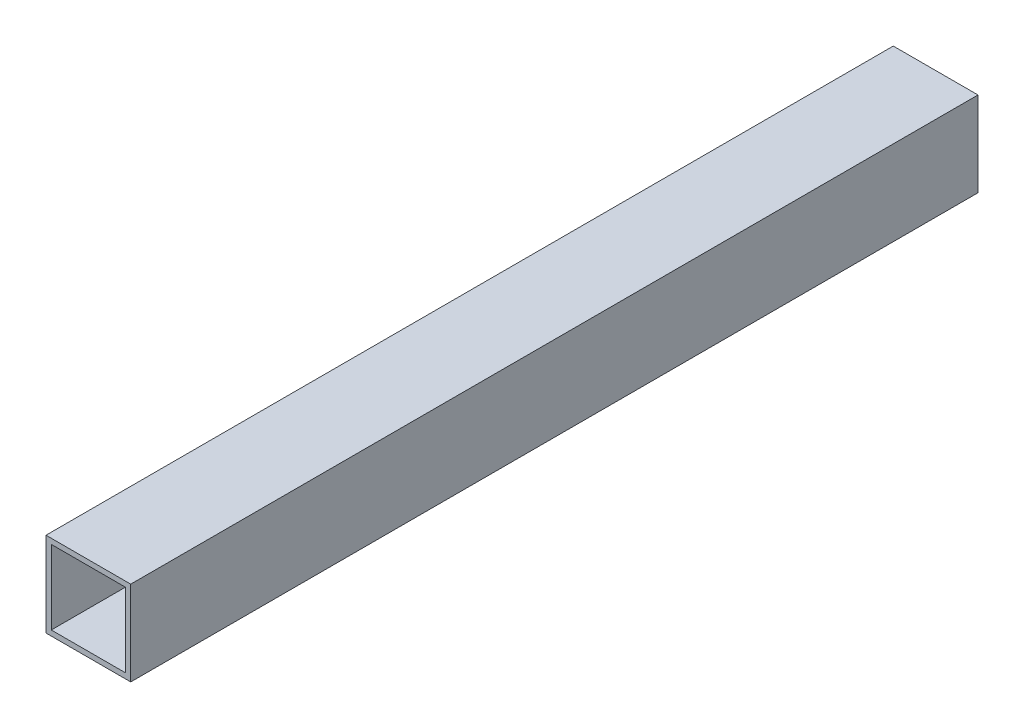
ISO-10303-21;
HEADER;
FILE_DESCRIPTION(('STEP AP214'),'2;1');
FILE_NAME('part.step','',(''),(''),'','','');
FILE_SCHEMA(('AUTOMOTIVE_DESIGN { 1 0 10303 214 1 1 1 1 }'));
ENDSEC;
DATA;
#1=APPLICATION_CONTEXT('core data for automotive mechanical design processes');
#2=APPLICATION_PROTOCOL_DEFINITION('international standard','automotive_design',2000,#1);
#3=PRODUCT_CONTEXT('',#1,'mechanical');
#4=PRODUCT('Part','Part','',(#3));
#5=PRODUCT_RELATED_PRODUCT_CATEGORY('part','',(#4));
#6=PRODUCT_DEFINITION_FORMATION('','',#4);
#7=PRODUCT_DEFINITION_CONTEXT('part definition',#1,'design');
#8=PRODUCT_DEFINITION('design','',#6,#7);
#9=PRODUCT_DEFINITION_SHAPE('','',#8);
#10=(LENGTH_UNIT() NAMED_UNIT(*) SI_UNIT(.MILLI.,.METRE.));
#11=(NAMED_UNIT(*) PLANE_ANGLE_UNIT() SI_UNIT($,.RADIAN.));
#12=(NAMED_UNIT(*) SI_UNIT($,.STERADIAN.) SOLID_ANGLE_UNIT());
#13=UNCERTAINTY_MEASURE_WITH_UNIT(LENGTH_MEASURE(1.E-05),#10,'distance_accuracy_value','');
#14=(GEOMETRIC_REPRESENTATION_CONTEXT(3) GLOBAL_UNCERTAINTY_ASSIGNED_CONTEXT((#13)) GLOBAL_UNIT_ASSIGNED_CONTEXT((#10,
#11,#12)) REPRESENTATION_CONTEXT('',''));
#15=CARTESIAN_POINT('',(0.,0.,0.));
#16=DIRECTION('',(0.,0.,1.));
#17=DIRECTION('',(1.,0.,0.));
#18=AXIS2_PLACEMENT_3D('',#15,#16,#17);
#19=CARTESIAN_POINT('',(0.,0.,508.));
#20=DIRECTION('',(0.,0.,-1.));
#21=DIRECTION('',(-1.,0.,0.));
#22=AXIS2_PLACEMENT_3D('',#19,#20,#21);
#23=PLANE('',#22);
#24=DIRECTION('',(0.,-1.,0.));
#25=VECTOR('',#24,1.);
#26=CARTESIAN_POINT('',(0.,0.,508.));
#27=LINE('',#26,#25);
#28=CARTESIAN_POINT('',(0.,50.8,508.));
#29=VERTEX_POINT('',#28);
#30=CARTESIAN_POINT('',(0.,0.,508.));
#31=VERTEX_POINT('',#30);
#32=EDGE_CURVE('E141',#29,#31,#27,.T.);
#33=ORIENTED_EDGE('',*,*,#32,.T.);
#34=DIRECTION('',(1.,0.,0.));
#35=VECTOR('',#34,1.);
#36=CARTESIAN_POINT('',(0.,0.,508.));
#37=LINE('',#36,#35);
#38=CARTESIAN_POINT('',(50.8,0.,508.));
#39=VERTEX_POINT('',#38);
#40=EDGE_CURVE('E144',#31,#39,#37,.T.);
#41=ORIENTED_EDGE('',*,*,#40,.T.);
#42=DIRECTION('',(0.,1.,0.));
#43=VECTOR('',#42,1.);
#44=CARTESIAN_POINT('',(50.8,0.,508.));
#45=LINE('',#44,#43);
#46=CARTESIAN_POINT('',(50.8,50.8,508.));
#47=VERTEX_POINT('',#46);
#48=EDGE_CURVE('E147',#39,#47,#45,.T.);
#49=ORIENTED_EDGE('',*,*,#48,.T.);
#50=DIRECTION('',(-1.,0.,0.));
#51=VECTOR('',#50,1.);
#52=CARTESIAN_POINT('',(0.,50.8,508.));
#53=LINE('',#52,#51);
#54=EDGE_CURVE('E149',#47,#29,#53,.T.);
#55=ORIENTED_EDGE('',*,*,#54,.T.);
#56=EDGE_LOOP('',(#33,#41,#49,#55));
#57=FACE_BOUND('',#56,.T.);
#58=DIRECTION('',(0.,-1.,0.));
#59=VECTOR('',#58,1.);
#60=CARTESIAN_POINT('',(3.175,3.175,508.));
#61=LINE('',#60,#59);
#62=CARTESIAN_POINT('',(3.175,47.625,508.));
#63=VERTEX_POINT('',#62);
#64=CARTESIAN_POINT('',(3.175,3.175,508.));
#65=VERTEX_POINT('',#64);
#66=EDGE_CURVE('E105',#63,#65,#61,.T.);
#67=ORIENTED_EDGE('',*,*,#66,.F.);
#68=DIRECTION('',(-1.,0.,0.));
#69=VECTOR('',#68,1.);
#70=CARTESIAN_POINT('',(3.175,47.625,508.));
#71=LINE('',#70,#69);
#72=CARTESIAN_POINT('',(47.625,47.625,508.));
#73=VERTEX_POINT('',#72);
#74=EDGE_CURVE('E127',#73,#63,#71,.T.);
#75=ORIENTED_EDGE('',*,*,#74,.F.);
#76=DIRECTION('',(0.,1.,0.));
#77=VECTOR('',#76,1.);
#78=CARTESIAN_POINT('',(47.625,3.175,508.));
#79=LINE('',#78,#77);
#80=CARTESIAN_POINT('',(47.625,3.175,508.));
#81=VERTEX_POINT('',#80);
#82=EDGE_CURVE('E125',#81,#73,#79,.T.);
#83=ORIENTED_EDGE('',*,*,#82,.F.);
#84=DIRECTION('',(1.,0.,0.));
#85=VECTOR('',#84,1.);
#86=CARTESIAN_POINT('',(3.175,3.175,508.));
#87=LINE('',#86,#85);
#88=EDGE_CURVE('E113',#65,#81,#87,.T.);
#89=ORIENTED_EDGE('',*,*,#88,.F.);
#90=EDGE_LOOP('',(#67,#75,#83,#89));
#91=FACE_BOUND('',#90,.T.);
#92=ADVANCED_FACE('F40',(#57,#91),#23,.F.);
#93=CARTESIAN_POINT('',(0.,0.,0.));
#94=DIRECTION('',(0.,0.,-1.));
#95=DIRECTION('',(-1.,0.,0.));
#96=AXIS2_PLACEMENT_3D('',#93,#94,#95);
#97=PLANE('',#96);
#98=DIRECTION('',(0.,-1.,0.));
#99=VECTOR('',#98,1.);
#100=CARTESIAN_POINT('',(0.,0.,0.));
#101=LINE('',#100,#99);
#102=CARTESIAN_POINT('',(0.,50.8,0.));
#103=VERTEX_POINT('',#102);
#104=CARTESIAN_POINT('',(0.,0.,0.));
#105=VERTEX_POINT('',#104);
#106=EDGE_CURVE('E121',#103,#105,#101,.T.);
#107=ORIENTED_EDGE('',*,*,#106,.F.);
#108=DIRECTION('',(-1.,0.,0.));
#109=VECTOR('',#108,1.);
#110=CARTESIAN_POINT('',(0.,50.8,0.));
#111=LINE('',#110,#109);
#112=CARTESIAN_POINT('',(50.8,50.8,0.));
#113=VERTEX_POINT('',#112);
#114=EDGE_CURVE('E145',#113,#103,#111,.T.);
#115=ORIENTED_EDGE('',*,*,#114,.F.);
#116=DIRECTION('',(0.,1.,0.));
#117=VECTOR('',#116,1.);
#118=CARTESIAN_POINT('',(50.8,0.,0.));
#119=LINE('',#118,#117);
#120=CARTESIAN_POINT('',(50.8,0.,0.));
#121=VERTEX_POINT('',#120);
#122=EDGE_CURVE('E156',#121,#113,#119,.T.);
#123=ORIENTED_EDGE('',*,*,#122,.F.);
#124=DIRECTION('',(1.,0.,0.));
#125=VECTOR('',#124,1.);
#126=CARTESIAN_POINT('',(0.,0.,0.));
#127=LINE('',#126,#125);
#128=EDGE_CURVE('E154',#105,#121,#127,.T.);
#129=ORIENTED_EDGE('',*,*,#128,.F.);
#130=EDGE_LOOP('',(#107,#115,#123,#129));
#131=FACE_BOUND('',#130,.T.);
#132=DIRECTION('',(-1.,0.,0.));
#133=VECTOR('',#132,1.);
#134=CARTESIAN_POINT('',(3.175,47.625,0.));
#135=LINE('',#134,#133);
#136=CARTESIAN_POINT('',(47.625,47.625,0.));
#137=VERTEX_POINT('',#136);
#138=CARTESIAN_POINT('',(3.175,47.625,0.));
#139=VERTEX_POINT('',#138);
#140=EDGE_CURVE('E114',#137,#139,#135,.T.);
#141=ORIENTED_EDGE('',*,*,#140,.T.);
#142=DIRECTION('',(0.,-1.,0.));
#143=VECTOR('',#142,1.);
#144=CARTESIAN_POINT('',(3.175,3.175,0.));
#145=LINE('',#144,#143);
#146=CARTESIAN_POINT('',(3.175,3.175,0.));
#147=VERTEX_POINT('',#146);
#148=EDGE_CURVE('E63',#139,#147,#145,.T.);
#149=ORIENTED_EDGE('',*,*,#148,.T.);
#150=DIRECTION('',(1.,0.,0.));
#151=VECTOR('',#150,1.);
#152=CARTESIAN_POINT('',(3.175,3.175,0.));
#153=LINE('',#152,#151);
#154=CARTESIAN_POINT('',(47.625,3.175,0.));
#155=VERTEX_POINT('',#154);
#156=EDGE_CURVE('E120',#147,#155,#153,.T.);
#157=ORIENTED_EDGE('',*,*,#156,.T.);
#158=DIRECTION('',(0.,1.,0.));
#159=VECTOR('',#158,1.);
#160=CARTESIAN_POINT('',(47.625,3.175,0.));
#161=LINE('',#160,#159);
#162=EDGE_CURVE('E133',#155,#137,#161,.T.);
#163=ORIENTED_EDGE('',*,*,#162,.T.);
#164=EDGE_LOOP('',(#141,#149,#157,#163));
#165=FACE_BOUND('',#164,.T.);
#166=ADVANCED_FACE('F174',(#131,#165),#97,.T.);
#167=CARTESIAN_POINT('',(0.,0.,508.));
#168=DIRECTION('',(1.,0.,0.));
#169=DIRECTION('',(0.,0.,-1.));
#170=AXIS2_PLACEMENT_3D('',#167,#168,#169);
#171=PLANE('',#170);
#172=ORIENTED_EDGE('',*,*,#106,.T.);
#173=DIRECTION('',(0.,0.,-1.));
#174=VECTOR('',#173,1.);
#175=CARTESIAN_POINT('',(0.,0.,508.));
#176=LINE('',#175,#174);
#177=EDGE_CURVE('E11',#31,#105,#176,.T.);
#178=ORIENTED_EDGE('',*,*,#177,.F.);
#179=ORIENTED_EDGE('',*,*,#32,.F.);
#180=DIRECTION('',(0.,0.,-1.));
#181=VECTOR('',#180,1.);
#182=CARTESIAN_POINT('',(0.,50.8,508.));
#183=LINE('',#182,#181);
#184=EDGE_CURVE('E151',#29,#103,#183,.T.);
#185=ORIENTED_EDGE('',*,*,#184,.T.);
#186=EDGE_LOOP('',(#172,#178,#179,#185));
#187=FACE_BOUND('',#186,.T.);
#188=ADVANCED_FACE('F42',(#187),#171,.F.);
#189=CARTESIAN_POINT('',(0.,0.,508.));
#190=DIRECTION('',(0.,1.,0.));
#191=DIRECTION('',(0.,0.,1.));
#192=AXIS2_PLACEMENT_3D('',#189,#190,#191);
#193=PLANE('',#192);
#194=ORIENTED_EDGE('',*,*,#128,.T.);
#195=DIRECTION('',(0.,0.,-1.));
#196=VECTOR('',#195,1.);
#197=CARTESIAN_POINT('',(50.8,0.,508.));
#198=LINE('',#197,#196);
#199=EDGE_CURVE('E48',#39,#121,#198,.T.);
#200=ORIENTED_EDGE('',*,*,#199,.F.);
#201=ORIENTED_EDGE('',*,*,#40,.F.);
#202=ORIENTED_EDGE('',*,*,#177,.T.);
#203=EDGE_LOOP('',(#194,#200,#201,#202));
#204=FACE_BOUND('',#203,.T.);
#205=ADVANCED_FACE('F184',(#204),#193,.F.);
#206=CARTESIAN_POINT('',(50.8,0.,508.));
#207=DIRECTION('',(-1.,0.,0.));
#208=DIRECTION('',(0.,0.,1.));
#209=AXIS2_PLACEMENT_3D('',#206,#207,#208);
#210=PLANE('',#209);
#211=ORIENTED_EDGE('',*,*,#122,.T.);
#212=DIRECTION('',(0.,0.,-1.));
#213=VECTOR('',#212,1.);
#214=CARTESIAN_POINT('',(50.8,50.8,508.));
#215=LINE('',#214,#213);
#216=EDGE_CURVE('E161',#47,#113,#215,.T.);
#217=ORIENTED_EDGE('',*,*,#216,.F.);
#218=ORIENTED_EDGE('',*,*,#48,.F.);
#219=ORIENTED_EDGE('',*,*,#199,.T.);
#220=EDGE_LOOP('',(#211,#217,#218,#219));
#221=FACE_BOUND('',#220,.T.);
#222=ADVANCED_FACE('F168',(#221),#210,.F.);
#223=CARTESIAN_POINT('',(0.,50.8,508.));
#224=DIRECTION('',(0.,-1.,0.));
#225=DIRECTION('',(0.,0.,-1.));
#226=AXIS2_PLACEMENT_3D('',#223,#224,#225);
#227=PLANE('',#226);
#228=ORIENTED_EDGE('',*,*,#114,.T.);
#229=ORIENTED_EDGE('',*,*,#184,.F.);
#230=ORIENTED_EDGE('',*,*,#54,.F.);
#231=ORIENTED_EDGE('',*,*,#216,.T.);
#232=EDGE_LOOP('',(#228,#229,#230,#231));
#233=FACE_BOUND('',#232,.T.);
#234=ADVANCED_FACE('F178',(#233),#227,.F.);
#235=CARTESIAN_POINT('',(3.175,3.175,508.));
#236=DIRECTION('',(1.,0.,0.));
#237=DIRECTION('',(0.,0.,-1.));
#238=AXIS2_PLACEMENT_3D('',#235,#236,#237);
#239=PLANE('',#238);
#240=ORIENTED_EDGE('',*,*,#148,.F.);
#241=DIRECTION('',(0.,0.,-1.));
#242=VECTOR('',#241,1.);
#243=CARTESIAN_POINT('',(3.175,47.625,508.));
#244=LINE('',#243,#242);
#245=EDGE_CURVE('E109',#63,#139,#244,.T.);
#246=ORIENTED_EDGE('',*,*,#245,.F.);
#247=ORIENTED_EDGE('',*,*,#66,.T.);
#248=DIRECTION('',(0.,0.,-1.));
#249=VECTOR('',#248,1.);
#250=CARTESIAN_POINT('',(3.175,3.175,508.));
#251=LINE('',#250,#249);
#252=EDGE_CURVE('E108',#65,#147,#251,.T.);
#253=ORIENTED_EDGE('',*,*,#252,.T.);
#254=EDGE_LOOP('',(#240,#246,#247,#253));
#255=FACE_BOUND('',#254,.T.);
#256=ADVANCED_FACE('F107',(#255),#239,.T.);
#257=CARTESIAN_POINT('',(3.175,3.175,508.));
#258=DIRECTION('',(0.,1.,0.));
#259=DIRECTION('',(0.,0.,1.));
#260=AXIS2_PLACEMENT_3D('',#257,#258,#259);
#261=PLANE('',#260);
#262=ORIENTED_EDGE('',*,*,#156,.F.);
#263=ORIENTED_EDGE('',*,*,#252,.F.);
#264=ORIENTED_EDGE('',*,*,#88,.T.);
#265=DIRECTION('',(0.,0.,-1.));
#266=VECTOR('',#265,1.);
#267=CARTESIAN_POINT('',(47.625,3.175,508.));
#268=LINE('',#267,#266);
#269=EDGE_CURVE('E122',#81,#155,#268,.T.);
#270=ORIENTED_EDGE('',*,*,#269,.T.);
#271=EDGE_LOOP('',(#262,#263,#264,#270));
#272=FACE_BOUND('',#271,.T.);
#273=ADVANCED_FACE('F117',(#272),#261,.T.);
#274=CARTESIAN_POINT('',(47.625,3.175,508.));
#275=DIRECTION('',(-1.,0.,0.));
#276=DIRECTION('',(0.,0.,1.));
#277=AXIS2_PLACEMENT_3D('',#274,#275,#276);
#278=PLANE('',#277);
#279=ORIENTED_EDGE('',*,*,#162,.F.);
#280=ORIENTED_EDGE('',*,*,#269,.F.);
#281=ORIENTED_EDGE('',*,*,#82,.T.);
#282=DIRECTION('',(0.,0.,-1.));
#283=VECTOR('',#282,1.);
#284=CARTESIAN_POINT('',(47.625,47.625,508.));
#285=LINE('',#284,#283);
#286=EDGE_CURVE('E55',#73,#137,#285,.T.);
#287=ORIENTED_EDGE('',*,*,#286,.T.);
#288=EDGE_LOOP('',(#279,#280,#281,#287));
#289=FACE_BOUND('',#288,.T.);
#290=ADVANCED_FACE('F207',(#289),#278,.T.);
#291=CARTESIAN_POINT('',(3.175,47.625,508.));
#292=DIRECTION('',(0.,-1.,0.));
#293=DIRECTION('',(0.,0.,-1.));
#294=AXIS2_PLACEMENT_3D('',#291,#292,#293);
#295=PLANE('',#294);
#296=ORIENTED_EDGE('',*,*,#140,.F.);
#297=ORIENTED_EDGE('',*,*,#286,.F.);
#298=ORIENTED_EDGE('',*,*,#74,.T.);
#299=ORIENTED_EDGE('',*,*,#245,.T.);
#300=EDGE_LOOP('',(#296,#297,#298,#299));
#301=FACE_BOUND('',#300,.T.);
#302=ADVANCED_FACE('F211',(#301),#295,.T.);
#303=CLOSED_SHELL('',(#92,#166,#188,#205,#222,#234,#256,#273,#290,#302));
#304=MANIFOLD_SOLID_BREP('B2',#303);
#305=ADVANCED_BREP_SHAPE_REPRESENTATION('',(#18,#304),#14);
#306=SHAPE_DEFINITION_REPRESENTATION(#9,#305);
ENDSEC;
END-ISO-10303-21;
